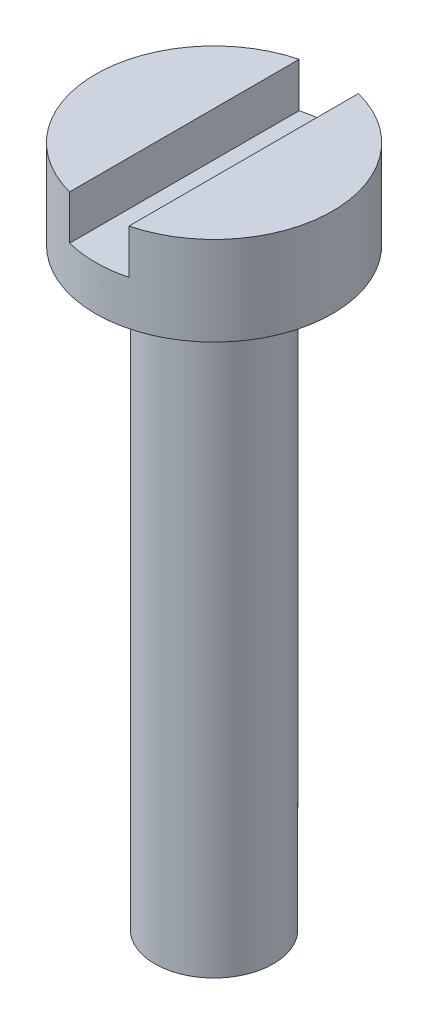
ISO-10303-21;
HEADER;
FILE_DESCRIPTION(('STEP AP214'),'2;1');
FILE_NAME('part.step','',(''),(''),'','','');
FILE_SCHEMA(('AUTOMOTIVE_DESIGN { 1 0 10303 214 1 1 1 1 }'));
ENDSEC;
DATA;
#1=APPLICATION_CONTEXT('core data for automotive mechanical design processes');
#2=APPLICATION_PROTOCOL_DEFINITION('international standard','automotive_design',2000,#1);
#3=PRODUCT_CONTEXT('',#1,'mechanical');
#4=PRODUCT('Part','Part','',(#3));
#5=PRODUCT_RELATED_PRODUCT_CATEGORY('part','',(#4));
#6=PRODUCT_DEFINITION_FORMATION('','',#4);
#7=PRODUCT_DEFINITION_CONTEXT('part definition',#1,'design');
#8=PRODUCT_DEFINITION('design','',#6,#7);
#9=PRODUCT_DEFINITION_SHAPE('','',#8);
#10=(LENGTH_UNIT() NAMED_UNIT(*) SI_UNIT(.MILLI.,.METRE.));
#11=(NAMED_UNIT(*) PLANE_ANGLE_UNIT() SI_UNIT($,.RADIAN.));
#12=(NAMED_UNIT(*) SI_UNIT($,.STERADIAN.) SOLID_ANGLE_UNIT());
#13=UNCERTAINTY_MEASURE_WITH_UNIT(LENGTH_MEASURE(1.E-05),#10,'distance_accuracy_value','');
#14=(GEOMETRIC_REPRESENTATION_CONTEXT(3) GLOBAL_UNCERTAINTY_ASSIGNED_CONTEXT((#13)) GLOBAL_UNIT_ASSIGNED_CONTEXT((#10,
#11,#12)) REPRESENTATION_CONTEXT('',''));
#15=CARTESIAN_POINT('',(0.,0.,0.));
#16=DIRECTION('',(0.,0.,1.));
#17=DIRECTION('',(1.,0.,0.));
#18=AXIS2_PLACEMENT_3D('',#15,#16,#17);
#19=CARTESIAN_POINT('',(0.,0.,0.));
#20=DIRECTION('',(0.,1.,0.));
#21=DIRECTION('',(0.,0.,1.));
#22=AXIS2_PLACEMENT_3D('',#19,#20,#21);
#23=PLANE('',#22);
#24=CARTESIAN_POINT('',(0.,0.,0.));
#25=DIRECTION('',(0.,1.,0.));
#26=DIRECTION('',(0.,0.,1.));
#27=AXIS2_PLACEMENT_3D('',#24,#25,#26);
#28=CIRCLE('',#27,4.);
#29=CARTESIAN_POINT('',(0.,0.,4.));
#30=VERTEX_POINT('',#29);
#31=EDGE_CURVE('E90',#30,#30,#28,.T.);
#32=ORIENTED_EDGE('',*,*,#31,.F.);
#33=EDGE_LOOP('',(#32));
#34=FACE_BOUND('',#33,.T.);
#35=CARTESIAN_POINT('',(0.,0.,0.));
#36=DIRECTION('',(0.,1.,0.));
#37=DIRECTION('',(0.,0.,1.));
#38=AXIS2_PLACEMENT_3D('',#35,#36,#37);
#39=CIRCLE('',#38,2.);
#40=CARTESIAN_POINT('',(0.,0.,2.));
#41=VERTEX_POINT('',#40);
#42=EDGE_CURVE('E11',#41,#41,#39,.F.);
#43=ORIENTED_EDGE('',*,*,#42,.F.);
#44=EDGE_LOOP('',(#43));
#45=FACE_BOUND('',#44,.T.);
#46=ADVANCED_FACE('F29',(#34,#45),#23,.F.);
#47=CARTESIAN_POINT('',(0.,3.,0.));
#48=DIRECTION('',(0.,1.,0.));
#49=DIRECTION('',(0.,0.,1.));
#50=AXIS2_PLACEMENT_3D('',#47,#48,#49);
#51=PLANE('',#50);
#52=DIRECTION('',(0.,0.,-1.));
#53=VECTOR('',#52,1.);
#54=CARTESIAN_POINT('',(1.,3.,0.));
#55=LINE('',#54,#53);
#56=CARTESIAN_POINT('',(1.,3.,3.87298334620742));
#57=VERTEX_POINT('',#56);
#58=CARTESIAN_POINT('',(1.,3.,-3.87298334620742));
#59=VERTEX_POINT('',#58);
#60=EDGE_CURVE('E77',#57,#59,#55,.T.);
#61=ORIENTED_EDGE('',*,*,#60,.F.);
#62=CARTESIAN_POINT('',(0.,3.,0.));
#63=DIRECTION('',(0.,1.,0.));
#64=DIRECTION('',(0.,0.,1.));
#65=AXIS2_PLACEMENT_3D('',#62,#63,#64);
#66=CIRCLE('',#65,4.);
#67=EDGE_CURVE('E78',#57,#59,#66,.T.);
#68=ORIENTED_EDGE('',*,*,#67,.T.);
#69=EDGE_LOOP('',(#61,#68));
#70=FACE_BOUND('',#69,.T.);
#71=ADVANCED_FACE('F110',(#70),#51,.T.);
#72=CARTESIAN_POINT('',(0.,3.,0.));
#73=DIRECTION('',(0.,-1.,0.));
#74=DIRECTION('',(0.,0.,-1.));
#75=AXIS2_PLACEMENT_3D('',#72,#73,#74);
#76=CYLINDRICAL_SURFACE('',#75,4.);
#77=CARTESIAN_POINT('',(0.,1.5,0.));
#78=DIRECTION('',(0.,1.,0.));
#79=DIRECTION('',(0.,0.,1.));
#80=AXIS2_PLACEMENT_3D('',#77,#78,#79);
#81=CIRCLE('',#80,4.);
#82=CARTESIAN_POINT('',(1.,1.5,-3.87298334620742));
#83=VERTEX_POINT('',#82);
#84=CARTESIAN_POINT('',(-1.,1.5,-3.87298334620742));
#85=VERTEX_POINT('',#84);
#86=EDGE_CURVE('E37',#83,#85,#81,.T.);
#87=ORIENTED_EDGE('',*,*,#86,.F.);
#88=DIRECTION('',(0.,-1.,0.));
#89=VECTOR('',#88,1.);
#90=CARTESIAN_POINT('',(1.,3.,-3.87298334620742));
#91=LINE('',#90,#89);
#92=EDGE_CURVE('E52',#83,#59,#91,.F.);
#93=ORIENTED_EDGE('',*,*,#92,.T.);
#94=ORIENTED_EDGE('',*,*,#67,.F.);
#95=DIRECTION('',(0.,-1.,0.));
#96=VECTOR('',#95,1.);
#97=CARTESIAN_POINT('',(1.,3.,3.87298334620742));
#98=LINE('',#97,#96);
#99=CARTESIAN_POINT('',(1.,1.5,3.87298334620742));
#100=VERTEX_POINT('',#99);
#101=EDGE_CURVE('E94',#57,#100,#98,.T.);
#102=ORIENTED_EDGE('',*,*,#101,.T.);
#103=CARTESIAN_POINT('',(-1.,1.5,3.87298334620742));
#104=VERTEX_POINT('',#103);
#105=EDGE_CURVE('E86',#104,#100,#81,.T.);
#106=ORIENTED_EDGE('',*,*,#105,.F.);
#107=DIRECTION('',(0.,-1.,0.));
#108=VECTOR('',#107,1.);
#109=CARTESIAN_POINT('',(-1.,3.,3.87298334620742));
#110=LINE('',#109,#108);
#111=CARTESIAN_POINT('',(-1.,3.,3.87298334620742));
#112=VERTEX_POINT('',#111);
#113=EDGE_CURVE('E72',#104,#112,#110,.F.);
#114=ORIENTED_EDGE('',*,*,#113,.T.);
#115=CARTESIAN_POINT('',(-1.,3.,-3.87298334620742));
#116=VERTEX_POINT('',#115);
#117=EDGE_CURVE('E84',#116,#112,#66,.T.);
#118=ORIENTED_EDGE('',*,*,#117,.F.);
#119=DIRECTION('',(0.,-1.,0.));
#120=VECTOR('',#119,1.);
#121=CARTESIAN_POINT('',(-1.,3.,-3.87298334620742));
#122=LINE('',#121,#120);
#123=EDGE_CURVE('E44',#116,#85,#122,.T.);
#124=ORIENTED_EDGE('',*,*,#123,.T.);
#125=EDGE_LOOP('',(#87,#93,#94,#102,#106,#114,#118,#124));
#126=FACE_BOUND('',#125,.T.);
#127=ORIENTED_EDGE('',*,*,#31,.T.);
#128=EDGE_LOOP('',(#127));
#129=FACE_BOUND('',#128,.T.);
#130=ADVANCED_FACE('F31',(#126,#129),#76,.T.);
#131=DIRECTION('',(0.,0.,1.));
#132=VECTOR('',#131,1.);
#133=CARTESIAN_POINT('',(-1.,3.,0.));
#134=LINE('',#133,#132);
#135=EDGE_CURVE('E69',#116,#112,#134,.T.);
#136=ORIENTED_EDGE('',*,*,#135,.F.);
#137=ORIENTED_EDGE('',*,*,#117,.T.);
#138=EDGE_LOOP('',(#136,#137));
#139=FACE_BOUND('',#138,.T.);
#140=ADVANCED_FACE('F89',(#139),#51,.T.);
#141=CARTESIAN_POINT('',(-1.,1.5,-5.0783360345759));
#142=DIRECTION('',(0.,1.,0.));
#143=DIRECTION('',(0.,0.,1.));
#144=AXIS2_PLACEMENT_3D('',#141,#142,#143);
#145=PLANE('',#144);
#146=ORIENTED_EDGE('',*,*,#86,.T.);
#147=DIRECTION('',(0.,0.,1.));
#148=VECTOR('',#147,1.);
#149=CARTESIAN_POINT('',(-1.,1.5,-5.0783360345759));
#150=LINE('',#149,#148);
#151=EDGE_CURVE('E100',#85,#104,#150,.T.);
#152=ORIENTED_EDGE('',*,*,#151,.T.);
#153=ORIENTED_EDGE('',*,*,#105,.T.);
#154=DIRECTION('',(0.,0.,-1.));
#155=VECTOR('',#154,1.);
#156=CARTESIAN_POINT('',(1.,1.5,4.40122456329912));
#157=LINE('',#156,#155);
#158=EDGE_CURVE('E87',#100,#83,#157,.T.);
#159=ORIENTED_EDGE('',*,*,#158,.T.);
#160=EDGE_LOOP('',(#146,#152,#153,#159));
#161=FACE_BOUND('',#160,.T.);
#162=ADVANCED_FACE('F99',(#161),#145,.T.);
#163=CARTESIAN_POINT('',(1.,1.5,4.40122456329912));
#164=DIRECTION('',(1.,0.,0.));
#165=DIRECTION('',(0.,0.,-1.));
#166=AXIS2_PLACEMENT_3D('',#163,#164,#165);
#167=PLANE('',#166);
#168=ORIENTED_EDGE('',*,*,#60,.T.);
#169=ORIENTED_EDGE('',*,*,#92,.F.);
#170=ORIENTED_EDGE('',*,*,#158,.F.);
#171=ORIENTED_EDGE('',*,*,#101,.F.);
#172=EDGE_LOOP('',(#168,#169,#170,#171));
#173=FACE_BOUND('',#172,.T.);
#174=ADVANCED_FACE('F108',(#173),#167,.F.);
#175=CARTESIAN_POINT('',(-1.,1.5,-5.0783360345759));
#176=DIRECTION('',(-1.,0.,0.));
#177=DIRECTION('',(0.,0.,1.));
#178=AXIS2_PLACEMENT_3D('',#175,#176,#177);
#179=PLANE('',#178);
#180=ORIENTED_EDGE('',*,*,#135,.T.);
#181=ORIENTED_EDGE('',*,*,#113,.F.);
#182=ORIENTED_EDGE('',*,*,#151,.F.);
#183=ORIENTED_EDGE('',*,*,#123,.F.);
#184=EDGE_LOOP('',(#180,#181,#182,#183));
#185=FACE_BOUND('',#184,.T.);
#186=ADVANCED_FACE('F71',(#185),#179,.F.);
#187=CARTESIAN_POINT('',(0.,-20.,0.));
#188=DIRECTION('',(0.,1.,0.));
#189=DIRECTION('',(0.,0.,1.));
#190=AXIS2_PLACEMENT_3D('',#187,#188,#189);
#191=CYLINDRICAL_SURFACE('',#190,2.);
#192=CARTESIAN_POINT('',(0.,-20.,0.));
#193=DIRECTION('',(0.,-1.,0.));
#194=DIRECTION('',(0.,0.,-1.));
#195=AXIS2_PLACEMENT_3D('',#192,#193,#194);
#196=CIRCLE('',#195,2.);
#197=CARTESIAN_POINT('',(0.,-20.,-2.));
#198=VERTEX_POINT('',#197);
#199=EDGE_CURVE('E101',#198,#198,#196,.T.);
#200=ORIENTED_EDGE('',*,*,#199,.F.);
#201=EDGE_LOOP('',(#200));
#202=FACE_BOUND('',#201,.T.);
#203=ORIENTED_EDGE('',*,*,#42,.T.);
#204=EDGE_LOOP('',(#203));
#205=FACE_BOUND('',#204,.T.);
#206=ADVANCED_FACE('F128',(#202,#205),#191,.T.);
#207=CARTESIAN_POINT('',(0.,-20.,0.));
#208=DIRECTION('',(0.,-1.,0.));
#209=DIRECTION('',(0.,0.,-1.));
#210=AXIS2_PLACEMENT_3D('',#207,#208,#209);
#211=PLANE('',#210);
#212=ORIENTED_EDGE('',*,*,#199,.T.);
#213=EDGE_LOOP('',(#212));
#214=FACE_BOUND('',#213,.T.);
#215=ADVANCED_FACE('F135',(#214),#211,.T.);
#216=CLOSED_SHELL('',(#46,#71,#130,#140,#162,#174,#186,#206,#215));
#217=MANIFOLD_SOLID_BREP('B2',#216);
#218=ADVANCED_BREP_SHAPE_REPRESENTATION('',(#18,#217),#14);
#219=SHAPE_DEFINITION_REPRESENTATION(#9,#218);
ENDSEC;
END-ISO-10303-21;
